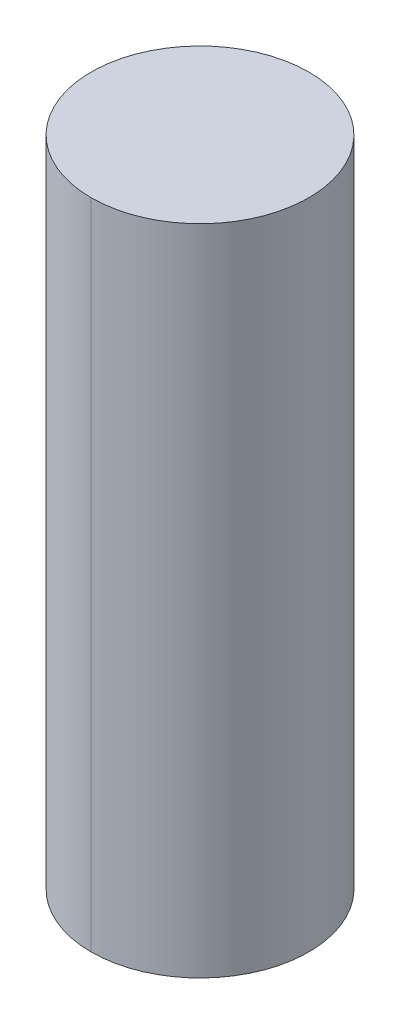
ISO-10303-21;
HEADER;
FILE_DESCRIPTION(('STEP AP214'),'2;1');
FILE_NAME('part.step','',(''),(''),'','','');
FILE_SCHEMA(('AUTOMOTIVE_DESIGN { 1 0 10303 214 1 1 1 1 }'));
ENDSEC;
DATA;
#1=APPLICATION_CONTEXT('core data for automotive mechanical design processes');
#2=APPLICATION_PROTOCOL_DEFINITION('international standard','automotive_design',2000,#1);
#3=PRODUCT_CONTEXT('',#1,'mechanical');
#4=PRODUCT('Part','Part','',(#3));
#5=PRODUCT_RELATED_PRODUCT_CATEGORY('part','',(#4));
#6=PRODUCT_DEFINITION_FORMATION('','',#4);
#7=PRODUCT_DEFINITION_CONTEXT('part definition',#1,'design');
#8=PRODUCT_DEFINITION('design','',#6,#7);
#9=PRODUCT_DEFINITION_SHAPE('','',#8);
#10=(LENGTH_UNIT() NAMED_UNIT(*) SI_UNIT(.MILLI.,.METRE.));
#11=(NAMED_UNIT(*) PLANE_ANGLE_UNIT() SI_UNIT($,.RADIAN.));
#12=(NAMED_UNIT(*) SI_UNIT($,.STERADIAN.) SOLID_ANGLE_UNIT());
#13=UNCERTAINTY_MEASURE_WITH_UNIT(LENGTH_MEASURE(1.E-05),#10,'distance_accuracy_value','');
#14=(GEOMETRIC_REPRESENTATION_CONTEXT(3) GLOBAL_UNCERTAINTY_ASSIGNED_CONTEXT((#13)) GLOBAL_UNIT_ASSIGNED_CONTEXT((#10,
#11,#12)) REPRESENTATION_CONTEXT('',''));
#15=CARTESIAN_POINT('',(0.,0.,0.));
#16=DIRECTION('',(0.,0.,1.));
#17=DIRECTION('',(1.,0.,0.));
#18=AXIS2_PLACEMENT_3D('',#15,#16,#17);
#19=CARTESIAN_POINT('',(0.,20.5,0.));
#20=DIRECTION('',(0.,-1.,0.));
#21=DIRECTION('',(0.,0.,-1.));
#22=AXIS2_PLACEMENT_3D('',#19,#20,#21);
#23=PLANE('',#22);
#24=CARTESIAN_POINT('',(0.,20.5,0.));
#25=DIRECTION('',(0.,-1.,0.));
#26=DIRECTION('',(0.,0.,-1.));
#27=AXIS2_PLACEMENT_3D('',#24,#25,#26);
#28=CIRCLE('',#27,1.);
#29=CARTESIAN_POINT('',(0.,20.5,1.));
#30=VERTEX_POINT('',#29);
#31=CARTESIAN_POINT('',(0.,20.5,-1.));
#32=VERTEX_POINT('',#31);
#33=EDGE_CURVE('E11',#30,#32,#28,.T.);
#34=ORIENTED_EDGE('',*,*,#33,.F.);
#35=CARTESIAN_POINT('',(0.,20.5,0.));
#36=DIRECTION('',(0.,-1.,0.));
#37=DIRECTION('',(0.,0.,-1.));
#38=AXIS2_PLACEMENT_3D('',#35,#36,#37);
#39=CIRCLE('',#38,1.);
#40=EDGE_CURVE('E25',#32,#30,#39,.T.);
#41=ORIENTED_EDGE('',*,*,#40,.F.);
#42=EDGE_LOOP('',(#34,#41));
#43=FACE_BOUND('',#42,.T.);
#44=ADVANCED_FACE('F17',(#43),#23,.F.);
#45=CARTESIAN_POINT('',(0.,14.5,0.));
#46=DIRECTION('',(0.,-1.,0.));
#47=DIRECTION('',(-1.,0.,0.));
#48=AXIS2_PLACEMENT_3D('',#45,#46,#47);
#49=CYLINDRICAL_SURFACE('',#48,1.);
#50=DIRECTION('',(0.,-1.,0.));
#51=VECTOR('',#50,1.);
#52=CARTESIAN_POINT('',(0.,20.5,1.));
#53=LINE('',#52,#51);
#54=CARTESIAN_POINT('',(0.,14.5,1.));
#55=VERTEX_POINT('',#54);
#56=EDGE_CURVE('E45',#30,#55,#53,.T.);
#57=ORIENTED_EDGE('',*,*,#56,.T.);
#58=CARTESIAN_POINT('',(0.,14.5,0.));
#59=DIRECTION('',(0.,-1.,0.));
#60=DIRECTION('',(0.,0.,-1.));
#61=AXIS2_PLACEMENT_3D('',#58,#59,#60);
#62=CIRCLE('',#61,1.);
#63=CARTESIAN_POINT('',(0.,14.5,-1.));
#64=VERTEX_POINT('',#63);
#65=EDGE_CURVE('E41',#64,#55,#62,.T.);
#66=ORIENTED_EDGE('',*,*,#65,.F.);
#67=DIRECTION('',(0.,-1.,0.));
#68=VECTOR('',#67,1.);
#69=CARTESIAN_POINT('',(0.,20.5,-1.));
#70=LINE('',#69,#68);
#71=EDGE_CURVE('E44',#32,#64,#70,.T.);
#72=ORIENTED_EDGE('',*,*,#71,.F.);
#73=ORIENTED_EDGE('',*,*,#40,.T.);
#74=EDGE_LOOP('',(#57,#66,#72,#73));
#75=FACE_BOUND('',#74,.T.);
#76=ADVANCED_FACE('F43',(#75),#49,.T.);
#77=CARTESIAN_POINT('',(0.,14.5,0.));
#78=DIRECTION('',(0.,-1.,0.));
#79=DIRECTION('',(1.,0.,0.));
#80=AXIS2_PLACEMENT_3D('',#77,#78,#79);
#81=CYLINDRICAL_SURFACE('',#80,1.);
#82=ORIENTED_EDGE('',*,*,#56,.F.);
#83=ORIENTED_EDGE('',*,*,#33,.T.);
#84=ORIENTED_EDGE('',*,*,#71,.T.);
#85=CARTESIAN_POINT('',(0.,14.5,0.));
#86=DIRECTION('',(0.,-1.,0.));
#87=DIRECTION('',(0.,0.,-1.));
#88=AXIS2_PLACEMENT_3D('',#85,#86,#87);
#89=CIRCLE('',#88,1.);
#90=EDGE_CURVE('E52',#55,#64,#89,.T.);
#91=ORIENTED_EDGE('',*,*,#90,.F.);
#92=EDGE_LOOP('',(#82,#83,#84,#91));
#93=FACE_BOUND('',#92,.T.);
#94=ADVANCED_FACE('F51',(#93),#81,.T.);
#95=CARTESIAN_POINT('',(0.,14.5,-1.));
#96=DIRECTION('',(0.,1.,0.));
#97=DIRECTION('',(0.,0.,1.));
#98=AXIS2_PLACEMENT_3D('',#95,#96,#97);
#99=PLANE('',#98);
#100=ORIENTED_EDGE('',*,*,#65,.T.);
#101=ORIENTED_EDGE('',*,*,#90,.T.);
#102=EDGE_LOOP('',(#100,#101));
#103=FACE_BOUND('',#102,.T.);
#104=ADVANCED_FACE('F54',(#103),#99,.F.);
#105=CLOSED_SHELL('',(#44,#76,#94,#104));
#106=MANIFOLD_SOLID_BREP('B1',#105);
#107=ADVANCED_BREP_SHAPE_REPRESENTATION('',(#18,#106),#14);
#108=SHAPE_DEFINITION_REPRESENTATION(#9,#107);
ENDSEC;
END-ISO-10303-21;
